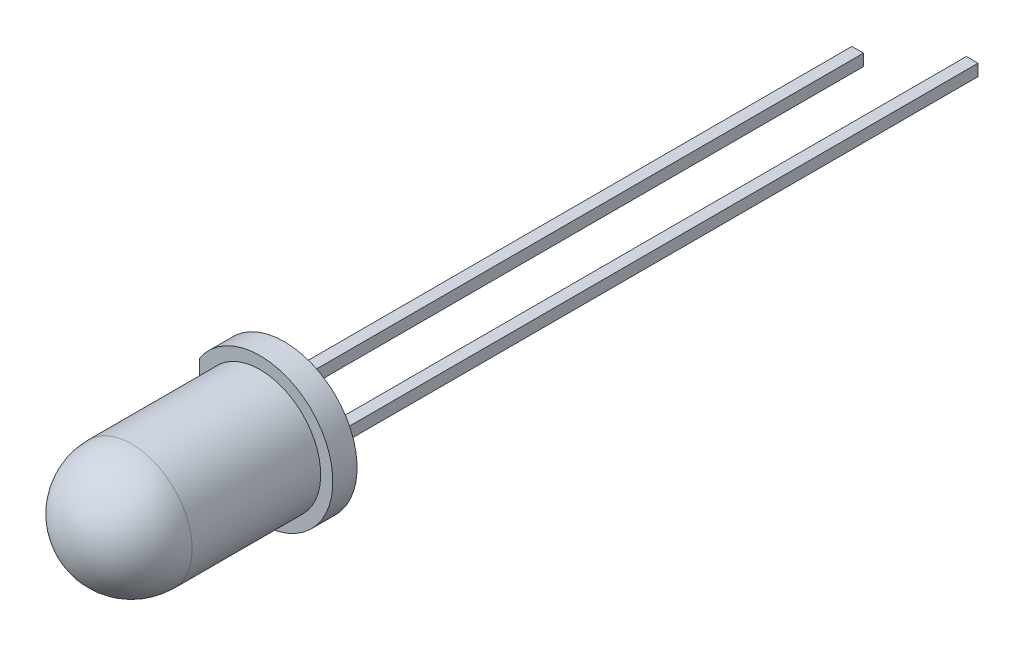
ISO-10303-21;
HEADER;
FILE_DESCRIPTION(('STEP AP214'),'2;1');
FILE_NAME('part.step','',(''),(''),'','','');
FILE_SCHEMA(('AUTOMOTIVE_DESIGN { 1 0 10303 214 1 1 1 1 }'));
ENDSEC;
DATA;
#1=APPLICATION_CONTEXT('core data for automotive mechanical design processes');
#2=APPLICATION_PROTOCOL_DEFINITION('international standard','automotive_design',2000,#1);
#3=PRODUCT_CONTEXT('',#1,'mechanical');
#4=PRODUCT('Part','Part','',(#3));
#5=PRODUCT_RELATED_PRODUCT_CATEGORY('part','',(#4));
#6=PRODUCT_DEFINITION_FORMATION('','',#4);
#7=PRODUCT_DEFINITION_CONTEXT('part definition',#1,'design');
#8=PRODUCT_DEFINITION('design','',#6,#7);
#9=PRODUCT_DEFINITION_SHAPE('','',#8);
#10=(LENGTH_UNIT() NAMED_UNIT(*) SI_UNIT(.MILLI.,.METRE.));
#11=(NAMED_UNIT(*) PLANE_ANGLE_UNIT() SI_UNIT($,.RADIAN.));
#12=(NAMED_UNIT(*) SI_UNIT($,.STERADIAN.) SOLID_ANGLE_UNIT());
#13=UNCERTAINTY_MEASURE_WITH_UNIT(LENGTH_MEASURE(1.E-05),#10,'distance_accuracy_value','');
#14=(GEOMETRIC_REPRESENTATION_CONTEXT(3) GLOBAL_UNCERTAINTY_ASSIGNED_CONTEXT((#13)) GLOBAL_UNIT_ASSIGNED_CONTEXT((#10,
#11,#12)) REPRESENTATION_CONTEXT('',''));
#15=CARTESIAN_POINT('',(0.,0.,0.));
#16=DIRECTION('',(0.,0.,1.));
#17=DIRECTION('',(1.,0.,0.));
#18=AXIS2_PLACEMENT_3D('',#15,#16,#17);
#19=CARTESIAN_POINT('',(-0.0499999999999997,0.,4.26666666666667));
#20=DIRECTION('',(0.,0.,1.));
#21=DIRECTION('',(-1.,0.,0.));
#22=AXIS2_PLACEMENT_3D('',#19,#20,#21);
#23=SPHERICAL_SURFACE('',#22,0.566666666666667);
#24=CARTESIAN_POINT('',(-0.0499999999999997,-0.24,4.26666666666667));
#25=DIRECTION('',(0.,1.,0.));
#26=DIRECTION('',(0.,0.,1.));
#27=AXIS2_PLACEMENT_3D('',#24,#25,#26);
#28=CIRCLE('',#27,0.513333333333333);
#29=CARTESIAN_POINT('',(-0.488634243989226,-0.24,4.));
#30=VERTEX_POINT('',#29);
#31=CARTESIAN_POINT('',(0.388634243989226,-0.24,4.));
#32=VERTEX_POINT('',#31);
#33=EDGE_CURVE('E204',#30,#32,#28,.F.);
#34=ORIENTED_EDGE('',*,*,#33,.T.);
#35=CARTESIAN_POINT('',(-0.0499999999999997,0.,4.));
#36=DIRECTION('',(0.,0.,1.));
#37=DIRECTION('',(1.,0.,0.));
#38=AXIS2_PLACEMENT_3D('',#35,#36,#37);
#39=CIRCLE('',#38,0.5);
#40=EDGE_CURVE('E71',#30,#32,#39,.T.);
#41=ORIENTED_EDGE('',*,*,#40,.F.);
#42=EDGE_LOOP('',(#34,#41));
#43=FACE_BOUND('',#42,.T.);
#44=ADVANCED_FACE('F62',(#43),#23,.T.);
#45=CARTESIAN_POINT('',(0.388634243989226,0.24,4.));
#46=VERTEX_POINT('',#45);
#47=CARTESIAN_POINT('',(-0.488634243989226,0.24,4.));
#48=VERTEX_POINT('',#47);
#49=EDGE_CURVE('E12',#46,#48,#39,.T.);
#50=ORIENTED_EDGE('',*,*,#49,.F.);
#51=CARTESIAN_POINT('',(-0.0499999999999997,0.24,4.26666666666667));
#52=DIRECTION('',(0.,1.,0.));
#53=DIRECTION('',(0.,0.,1.));
#54=AXIS2_PLACEMENT_3D('',#51,#52,#53);
#55=CIRCLE('',#54,0.513333333333333);
#56=EDGE_CURVE('E232',#48,#46,#55,.F.);
#57=ORIENTED_EDGE('',*,*,#56,.F.);
#58=EDGE_LOOP('',(#50,#57));
#59=FACE_BOUND('',#58,.T.);
#60=ADVANCED_FACE('F64',(#59),#23,.T.);
#61=CARTESIAN_POINT('',(-0.55,0.,4.));
#62=DIRECTION('',(0.,0.,-1.));
#63=DIRECTION('',(-1.,0.,0.));
#64=AXIS2_PLACEMENT_3D('',#61,#62,#63);
#65=PLANE('',#64);
#66=CARTESIAN_POINT('',(-0.0499999999999997,0.,4.));
#67=DIRECTION('',(0.,0.,1.));
#68=DIRECTION('',(1.,0.,0.));
#69=AXIS2_PLACEMENT_3D('',#66,#67,#68);
#70=CIRCLE('',#69,0.2);
#71=CARTESIAN_POINT('',(0.15,0.,4.));
#72=VERTEX_POINT('',#71);
#73=EDGE_CURVE('E317',#72,#72,#70,.T.);
#74=ORIENTED_EDGE('',*,*,#73,.F.);
#75=EDGE_LOOP('',(#74));
#76=FACE_BOUND('',#75,.T.);
#77=ORIENTED_EDGE('',*,*,#49,.T.);
#78=DIRECTION('',(1.,0.,0.));
#79=VECTOR('',#78,1.);
#80=CARTESIAN_POINT('',(-1.3,0.24,4.));
#81=LINE('',#80,#79);
#82=CARTESIAN_POINT('',(-1.3,0.24,4.));
#83=VERTEX_POINT('',#82);
#84=EDGE_CURVE('E128',#83,#48,#81,.T.);
#85=ORIENTED_EDGE('',*,*,#84,.F.);
#86=DIRECTION('',(0.,-1.,0.));
#87=VECTOR('',#86,1.);
#88=CARTESIAN_POINT('',(-1.3,0.24,4.));
#89=LINE('',#88,#87);
#90=CARTESIAN_POINT('',(-1.3,-0.24,4.));
#91=VERTEX_POINT('',#90);
#92=EDGE_CURVE('E202',#83,#91,#89,.T.);
#93=ORIENTED_EDGE('',*,*,#92,.T.);
#94=DIRECTION('',(1.,0.,0.));
#95=VECTOR('',#94,1.);
#96=CARTESIAN_POINT('',(-1.3,-0.24,4.));
#97=LINE('',#96,#95);
#98=EDGE_CURVE('E81',#91,#30,#97,.T.);
#99=ORIENTED_EDGE('',*,*,#98,.T.);
#100=ORIENTED_EDGE('',*,*,#40,.T.);
#101=CARTESIAN_POINT('',(1.2,-0.24,4.));
#102=VERTEX_POINT('',#101);
#103=EDGE_CURVE('E180',#32,#102,#97,.T.);
#104=ORIENTED_EDGE('',*,*,#103,.T.);
#105=DIRECTION('',(0.,-1.,0.));
#106=VECTOR('',#105,1.);
#107=CARTESIAN_POINT('',(1.2,0.24,4.));
#108=LINE('',#107,#106);
#109=CARTESIAN_POINT('',(1.2,0.24,4.));
#110=VERTEX_POINT('',#109);
#111=EDGE_CURVE('E160',#110,#102,#108,.T.);
#112=ORIENTED_EDGE('',*,*,#111,.F.);
#113=EDGE_CURVE('E146',#46,#110,#81,.T.);
#114=ORIENTED_EDGE('',*,*,#113,.F.);
#115=EDGE_LOOP('',(#77,#85,#93,#99,#100,#104,#112,#114));
#116=FACE_BOUND('',#115,.T.);
#117=ADVANCED_FACE('F214',(#76,#116),#65,.F.);
#118=CARTESIAN_POINT('',(0.,0.24,0.));
#119=DIRECTION('',(0.,1.,0.));
#120=DIRECTION('',(0.,0.,1.));
#121=AXIS2_PLACEMENT_3D('',#118,#119,#120);
#122=PLANE('',#121);
#123=ORIENTED_EDGE('',*,*,#84,.T.);
#124=ORIENTED_EDGE('',*,*,#56,.T.);
#125=ORIENTED_EDGE('',*,*,#113,.T.);
#126=DIRECTION('',(-0.508148861978286,0.,-0.861269257590315));
#127=VECTOR('',#126,1.);
#128=CARTESIAN_POINT('',(1.2,0.24,4.));
#129=LINE('',#128,#127);
#130=CARTESIAN_POINT('',(0.0199999999999998,0.24,2.));
#131=VERTEX_POINT('',#130);
#132=EDGE_CURVE('E137',#110,#131,#129,.T.);
#133=ORIENTED_EDGE('',*,*,#132,.T.);
#134=DIRECTION('',(-1.,0.,0.));
#135=VECTOR('',#134,1.);
#136=CARTESIAN_POINT('',(0.0199999999999998,0.24,2.));
#137=LINE('',#136,#135);
#138=CARTESIAN_POINT('',(-1.12,0.24,2.));
#139=VERTEX_POINT('',#138);
#140=EDGE_CURVE('E142',#131,#139,#137,.T.);
#141=ORIENTED_EDGE('',*,*,#140,.T.);
#142=DIRECTION('',(0.,0.,-1.));
#143=VECTOR('',#142,1.);
#144=CARTESIAN_POINT('',(-1.12,0.24,2.));
#145=LINE('',#144,#143);
#146=CARTESIAN_POINT('',(-1.12,0.24,-25.));
#147=VERTEX_POINT('',#146);
#148=EDGE_CURVE('E167',#139,#147,#145,.T.);
#149=ORIENTED_EDGE('',*,*,#148,.T.);
#150=DIRECTION('',(1.,0.,0.));
#151=VECTOR('',#150,1.);
#152=CARTESIAN_POINT('',(-1.12,0.24,-25.));
#153=LINE('',#152,#151);
#154=CARTESIAN_POINT('',(-1.6,0.24,-25.));
#155=VERTEX_POINT('',#154);
#156=EDGE_CURVE('E181',#155,#147,#153,.T.);
#157=ORIENTED_EDGE('',*,*,#156,.F.);
#158=DIRECTION('',(0.,0.,1.));
#159=VECTOR('',#158,1.);
#160=CARTESIAN_POINT('',(-1.6,0.24,0.));
#161=LINE('',#160,#159);
#162=CARTESIAN_POINT('',(-1.6,0.24,3.5));
#163=VERTEX_POINT('',#162);
#164=EDGE_CURVE('E93',#155,#163,#161,.T.);
#165=ORIENTED_EDGE('',*,*,#164,.T.);
#166=DIRECTION('',(0.514495755427526,0.,0.857492925712544));
#167=VECTOR('',#166,1.);
#168=CARTESIAN_POINT('',(-1.6,0.24,3.5));
#169=LINE('',#168,#167);
#170=EDGE_CURVE('E195',#163,#83,#169,.T.);
#171=ORIENTED_EDGE('',*,*,#170,.T.);
#172=EDGE_LOOP('',(#123,#124,#125,#133,#141,#149,#157,#165,#171));
#173=FACE_BOUND('',#172,.T.);
#174=ADVANCED_FACE('F139',(#173),#122,.T.);
#175=CARTESIAN_POINT('',(0.,-0.24,0.));
#176=DIRECTION('',(0.,1.,0.));
#177=DIRECTION('',(0.,0.,1.));
#178=AXIS2_PLACEMENT_3D('',#175,#176,#177);
#179=PLANE('',#178);
#180=ORIENTED_EDGE('',*,*,#33,.F.);
#181=ORIENTED_EDGE('',*,*,#98,.F.);
#182=DIRECTION('',(0.514495755427526,0.,0.857492925712544));
#183=VECTOR('',#182,1.);
#184=CARTESIAN_POINT('',(-1.6,-0.24,3.5));
#185=LINE('',#184,#183);
#186=CARTESIAN_POINT('',(-1.6,-0.24,3.5));
#187=VERTEX_POINT('',#186);
#188=EDGE_CURVE('E176',#187,#91,#185,.T.);
#189=ORIENTED_EDGE('',*,*,#188,.F.);
#190=DIRECTION('',(0.,0.,1.));
#191=VECTOR('',#190,1.);
#192=CARTESIAN_POINT('',(-1.6,-0.24,0.));
#193=LINE('',#192,#191);
#194=CARTESIAN_POINT('',(-1.6,-0.24,-25.));
#195=VERTEX_POINT('',#194);
#196=EDGE_CURVE('E122',#195,#187,#193,.T.);
#197=ORIENTED_EDGE('',*,*,#196,.F.);
#198=DIRECTION('',(-1.,0.,0.));
#199=VECTOR('',#198,1.);
#200=CARTESIAN_POINT('',(-1.12,-0.24,-25.));
#201=LINE('',#200,#199);
#202=CARTESIAN_POINT('',(-1.12,-0.24,-25.));
#203=VERTEX_POINT('',#202);
#204=EDGE_CURVE('E259',#203,#195,#201,.T.);
#205=ORIENTED_EDGE('',*,*,#204,.F.);
#206=DIRECTION('',(0.,0.,-1.));
#207=VECTOR('',#206,1.);
#208=CARTESIAN_POINT('',(-1.12,-0.24,2.));
#209=LINE('',#208,#207);
#210=CARTESIAN_POINT('',(-1.12,-0.24,2.));
#211=VERTEX_POINT('',#210);
#212=EDGE_CURVE('E189',#211,#203,#209,.T.);
#213=ORIENTED_EDGE('',*,*,#212,.F.);
#214=DIRECTION('',(-1.,0.,0.));
#215=VECTOR('',#214,1.);
#216=CARTESIAN_POINT('',(0.0199999999999998,-0.24,2.));
#217=LINE('',#216,#215);
#218=CARTESIAN_POINT('',(0.0199999999999998,-0.24,2.));
#219=VERTEX_POINT('',#218);
#220=EDGE_CURVE('E186',#219,#211,#217,.T.);
#221=ORIENTED_EDGE('',*,*,#220,.F.);
#222=DIRECTION('',(-0.508148861978286,0.,-0.861269257590315));
#223=VECTOR('',#222,1.);
#224=CARTESIAN_POINT('',(1.2,-0.24,4.));
#225=LINE('',#224,#223);
#226=EDGE_CURVE('E156',#102,#219,#225,.T.);
#227=ORIENTED_EDGE('',*,*,#226,.F.);
#228=ORIENTED_EDGE('',*,*,#103,.F.);
#229=EDGE_LOOP('',(#180,#181,#189,#197,#205,#213,#221,#227,#228));
#230=FACE_BOUND('',#229,.T.);
#231=ADVANCED_FACE('F278',(#230),#179,.F.);
#232=CARTESIAN_POINT('',(-1.6,0.24,3.5));
#233=DIRECTION('',(0.857492925712544,0.,-0.514495755427526));
#234=DIRECTION('',(-0.514495755427526,0.,-0.857492925712544));
#235=AXIS2_PLACEMENT_3D('',#232,#233,#234);
#236=PLANE('',#235);
#237=ORIENTED_EDGE('',*,*,#188,.T.);
#238=ORIENTED_EDGE('',*,*,#92,.F.);
#239=ORIENTED_EDGE('',*,*,#170,.F.);
#240=DIRECTION('',(0.,-1.,0.));
#241=VECTOR('',#240,1.);
#242=CARTESIAN_POINT('',(-1.6,0.24,3.5));
#243=LINE('',#242,#241);
#244=EDGE_CURVE('E175',#163,#187,#243,.T.);
#245=ORIENTED_EDGE('',*,*,#244,.T.);
#246=EDGE_LOOP('',(#237,#238,#239,#245));
#247=FACE_BOUND('',#246,.T.);
#248=ADVANCED_FACE('F275',(#247),#236,.F.);
#249=CARTESIAN_POINT('',(1.2,0.24,4.));
#250=DIRECTION('',(-0.861269257590315,0.,0.508148861978286));
#251=DIRECTION('',(0.508148861978286,0.,0.861269257590315));
#252=AXIS2_PLACEMENT_3D('',#249,#250,#251);
#253=PLANE('',#252);
#254=ORIENTED_EDGE('',*,*,#226,.T.);
#255=DIRECTION('',(0.,-1.,0.));
#256=VECTOR('',#255,1.);
#257=CARTESIAN_POINT('',(0.0199999999999998,0.24,2.));
#258=LINE('',#257,#256);
#259=EDGE_CURVE('E153',#131,#219,#258,.T.);
#260=ORIENTED_EDGE('',*,*,#259,.F.);
#261=ORIENTED_EDGE('',*,*,#132,.F.);
#262=ORIENTED_EDGE('',*,*,#111,.T.);
#263=EDGE_LOOP('',(#254,#260,#261,#262));
#264=FACE_BOUND('',#263,.T.);
#265=ADVANCED_FACE('F154',(#264),#253,.F.);
#266=CARTESIAN_POINT('',(0.0199999999999998,0.24,2.));
#267=DIRECTION('',(0.,0.,1.));
#268=DIRECTION('',(1.,0.,0.));
#269=AXIS2_PLACEMENT_3D('',#266,#267,#268);
#270=PLANE('',#269);
#271=ORIENTED_EDGE('',*,*,#220,.T.);
#272=DIRECTION('',(0.,-1.,0.));
#273=VECTOR('',#272,1.);
#274=CARTESIAN_POINT('',(-1.12,0.24,2.));
#275=LINE('',#274,#273);
#276=EDGE_CURVE('E161',#139,#211,#275,.T.);
#277=ORIENTED_EDGE('',*,*,#276,.F.);
#278=ORIENTED_EDGE('',*,*,#140,.F.);
#279=ORIENTED_EDGE('',*,*,#259,.T.);
#280=EDGE_LOOP('',(#271,#277,#278,#279));
#281=FACE_BOUND('',#280,.T.);
#282=ADVANCED_FACE('F163',(#281),#270,.F.);
#283=CARTESIAN_POINT('',(-1.12,0.24,2.));
#284=DIRECTION('',(-1.,0.,0.));
#285=DIRECTION('',(0.,0.,1.));
#286=AXIS2_PLACEMENT_3D('',#283,#284,#285);
#287=PLANE('',#286);
#288=ORIENTED_EDGE('',*,*,#212,.T.);
#289=DIRECTION('',(0.,-1.,0.));
#290=VECTOR('',#289,1.);
#291=CARTESIAN_POINT('',(-1.12,-0.24,-25.));
#292=LINE('',#291,#290);
#293=EDGE_CURVE('E251',#147,#203,#292,.T.);
#294=ORIENTED_EDGE('',*,*,#293,.F.);
#295=ORIENTED_EDGE('',*,*,#148,.F.);
#296=ORIENTED_EDGE('',*,*,#276,.T.);
#297=EDGE_LOOP('',(#288,#294,#295,#296));
#298=FACE_BOUND('',#297,.T.);
#299=ADVANCED_FACE('F255',(#298),#287,.F.);
#300=CARTESIAN_POINT('',(-1.6,0.24,0.));
#301=DIRECTION('',(1.,0.,0.));
#302=DIRECTION('',(0.,0.,-1.));
#303=AXIS2_PLACEMENT_3D('',#300,#301,#302);
#304=PLANE('',#303);
#305=ORIENTED_EDGE('',*,*,#196,.T.);
#306=ORIENTED_EDGE('',*,*,#244,.F.);
#307=ORIENTED_EDGE('',*,*,#164,.F.);
#308=DIRECTION('',(0.,1.,0.));
#309=VECTOR('',#308,1.);
#310=CARTESIAN_POINT('',(-1.6,-0.24,-25.));
#311=LINE('',#310,#309);
#312=EDGE_CURVE('E252',#195,#155,#311,.T.);
#313=ORIENTED_EDGE('',*,*,#312,.F.);
#314=EDGE_LOOP('',(#305,#306,#307,#313));
#315=FACE_BOUND('',#314,.T.);
#316=ADVANCED_FACE('F279',(#315),#304,.F.);
#317=CARTESIAN_POINT('',(0.,0.,-25.));
#318=DIRECTION('',(0.,0.,1.));
#319=DIRECTION('',(1.,0.,0.));
#320=AXIS2_PLACEMENT_3D('',#317,#318,#319);
#321=PLANE('',#320);
#322=ORIENTED_EDGE('',*,*,#293,.T.);
#323=ORIENTED_EDGE('',*,*,#204,.T.);
#324=ORIENTED_EDGE('',*,*,#312,.T.);
#325=ORIENTED_EDGE('',*,*,#156,.T.);
#326=EDGE_LOOP('',(#322,#323,#324,#325));
#327=FACE_BOUND('',#326,.T.);
#328=ADVANCED_FACE('F249',(#327),#321,.F.);
#329=CARTESIAN_POINT('',(-0.0499999999999997,0.,3.9));
#330=DIRECTION('',(0.,0.,1.));
#331=DIRECTION('',(1.,0.,0.));
#332=AXIS2_PLACEMENT_3D('',#329,#330,#331);
#333=CYLINDRICAL_SURFACE('',#332,0.2);
#334=CARTESIAN_POINT('',(-0.0499999999999997,0.,3.9));
#335=DIRECTION('',(0.,0.,1.));
#336=DIRECTION('',(1.,0.,0.));
#337=AXIS2_PLACEMENT_3D('',#334,#335,#336);
#338=CIRCLE('',#337,0.2);
#339=CARTESIAN_POINT('',(0.15,0.,3.9));
#340=VERTEX_POINT('',#339);
#341=EDGE_CURVE('E264',#340,#340,#338,.T.);
#342=ORIENTED_EDGE('',*,*,#341,.F.);
#343=EDGE_LOOP('',(#342));
#344=FACE_BOUND('',#343,.T.);
#345=ORIENTED_EDGE('',*,*,#73,.T.);
#346=EDGE_LOOP('',(#345));
#347=FACE_BOUND('',#346,.T.);
#348=ADVANCED_FACE('F286',(#344,#347),#333,.F.);
#349=CARTESIAN_POINT('',(-0.0499999999999997,0.,3.9));
#350=DIRECTION('',(0.,0.,1.));
#351=DIRECTION('',(1.,0.,0.));
#352=AXIS2_PLACEMENT_3D('',#349,#350,#351);
#353=PLANE('',#352);
#354=ORIENTED_EDGE('',*,*,#341,.T.);
#355=EDGE_LOOP('',(#354));
#356=FACE_BOUND('',#355,.T.);
#357=ADVANCED_FACE('F308',(#356),#353,.T.);
#358=CLOSED_SHELL('',(#44,#60,#117,#174,#231,#248,#265,#282,#299,#316,#328,#348,#357));
#359=MANIFOLD_SOLID_BREP('B2',#358);
#360=CARTESIAN_POINT('',(1.12,0.24,2.));
#361=DIRECTION('',(0.,0.,1.));
#362=DIRECTION('',(1.,0.,0.));
#363=AXIS2_PLACEMENT_3D('',#360,#361,#362);
#364=PLANE('',#363);
#365=DIRECTION('',(-1.,0.,0.));
#366=VECTOR('',#365,1.);
#367=CARTESIAN_POINT('',(1.12,-0.24,2.));
#368=LINE('',#367,#366);
#369=CARTESIAN_POINT('',(1.12,-0.24,2.));
#370=VERTEX_POINT('',#369);
#371=CARTESIAN_POINT('',(0.22,-0.24,2.));
#372=VERTEX_POINT('',#371);
#373=EDGE_CURVE('E539',#370,#372,#368,.T.);
#374=ORIENTED_EDGE('',*,*,#373,.T.);
#375=DIRECTION('',(0.,-1.,0.));
#376=VECTOR('',#375,1.);
#377=CARTESIAN_POINT('',(0.22,0.24,2.));
#378=LINE('',#377,#376);
#379=CARTESIAN_POINT('',(0.22,0.24,2.));
#380=VERTEX_POINT('',#379);
#381=EDGE_CURVE('E60',#380,#372,#378,.T.);
#382=ORIENTED_EDGE('',*,*,#381,.F.);
#383=DIRECTION('',(-1.,0.,0.));
#384=VECTOR('',#383,1.);
#385=CARTESIAN_POINT('',(1.12,0.24,2.));
#386=LINE('',#385,#384);
#387=CARTESIAN_POINT('',(1.12,0.24,2.));
#388=VERTEX_POINT('',#387);
#389=EDGE_CURVE('E540',#388,#380,#386,.T.);
#390=ORIENTED_EDGE('',*,*,#389,.F.);
#391=DIRECTION('',(0.,-1.,0.));
#392=VECTOR('',#391,1.);
#393=CARTESIAN_POINT('',(1.12,0.24,2.));
#394=LINE('',#393,#392);
#395=EDGE_CURVE('E549',#388,#370,#394,.T.);
#396=ORIENTED_EDGE('',*,*,#395,.T.);
#397=EDGE_LOOP('',(#374,#382,#390,#396));
#398=FACE_BOUND('',#397,.T.);
#399=ADVANCED_FACE('F434',(#398),#364,.F.);
#400=CARTESIAN_POINT('',(0.22,0.24,2.));
#401=DIRECTION('',(0.861269257590315,0.,-0.508148861978286));
#402=DIRECTION('',(-0.508148861978286,0.,-0.861269257590315));
#403=AXIS2_PLACEMENT_3D('',#400,#401,#402);
#404=PLANE('',#403);
#405=DIRECTION('',(0.508148861978286,0.,0.861269257590315));
#406=VECTOR('',#405,1.);
#407=CARTESIAN_POINT('',(0.22,-0.24,2.));
#408=LINE('',#407,#406);
#409=CARTESIAN_POINT('',(1.4,-0.24,4.));
#410=VERTEX_POINT('',#409);
#411=EDGE_CURVE('E553',#372,#410,#408,.T.);
#412=ORIENTED_EDGE('',*,*,#411,.T.);
#413=DIRECTION('',(0.,-1.,0.));
#414=VECTOR('',#413,1.);
#415=CARTESIAN_POINT('',(1.4,0.24,4.));
#416=LINE('',#415,#414);
#417=CARTESIAN_POINT('',(1.4,0.24,4.));
#418=VERTEX_POINT('',#417);
#419=EDGE_CURVE('E443',#418,#410,#416,.T.);
#420=ORIENTED_EDGE('',*,*,#419,.F.);
#421=DIRECTION('',(0.508148861978286,0.,0.861269257590315));
#422=VECTOR('',#421,1.);
#423=CARTESIAN_POINT('',(0.22,0.24,2.));
#424=LINE('',#423,#422);
#425=EDGE_CURVE('E492',#380,#418,#424,.T.);
#426=ORIENTED_EDGE('',*,*,#425,.F.);
#427=ORIENTED_EDGE('',*,*,#381,.T.);
#428=EDGE_LOOP('',(#412,#420,#426,#427));
#429=FACE_BOUND('',#428,.T.);
#430=ADVANCED_FACE('F574',(#429),#404,.F.);
#431=CARTESIAN_POINT('',(1.4,0.24,4.));
#432=DIRECTION('',(0.,0.,-1.));
#433=DIRECTION('',(-1.,0.,0.));
#434=AXIS2_PLACEMENT_3D('',#431,#432,#433);
#435=PLANE('',#434);
#436=DIRECTION('',(1.,0.,0.));
#437=VECTOR('',#436,1.);
#438=CARTESIAN_POINT('',(1.4,-0.24,4.));
#439=LINE('',#438,#437);
#440=CARTESIAN_POINT('',(1.6,-0.24,4.));
#441=VERTEX_POINT('',#440);
#442=EDGE_CURVE('E477',#410,#441,#439,.T.);
#443=ORIENTED_EDGE('',*,*,#442,.T.);
#444=DIRECTION('',(0.,-1.,0.));
#445=VECTOR('',#444,1.);
#446=CARTESIAN_POINT('',(1.6,0.24,4.));
#447=LINE('',#446,#445);
#448=CARTESIAN_POINT('',(1.6,0.24,4.));
#449=VERTEX_POINT('',#448);
#450=EDGE_CURVE('E564',#449,#441,#447,.T.);
#451=ORIENTED_EDGE('',*,*,#450,.F.);
#452=DIRECTION('',(1.,0.,0.));
#453=VECTOR('',#452,1.);
#454=CARTESIAN_POINT('',(1.4,0.24,4.));
#455=LINE('',#454,#453);
#456=EDGE_CURVE('E513',#418,#449,#455,.T.);
#457=ORIENTED_EDGE('',*,*,#456,.F.);
#458=ORIENTED_EDGE('',*,*,#419,.T.);
#459=EDGE_LOOP('',(#443,#451,#457,#458));
#460=FACE_BOUND('',#459,.T.);
#461=ADVANCED_FACE('F566',(#460),#435,.F.);
#462=CARTESIAN_POINT('',(1.6,0.24,4.));
#463=DIRECTION('',(-1.,0.,0.));
#464=DIRECTION('',(0.,0.,1.));
#465=AXIS2_PLACEMENT_3D('',#462,#463,#464);
#466=PLANE('',#465);
#467=DIRECTION('',(0.,0.,-1.));
#468=VECTOR('',#467,1.);
#469=CARTESIAN_POINT('',(1.6,-0.24,4.));
#470=LINE('',#469,#468);
#471=CARTESIAN_POINT('',(1.6,-0.24,-27.));
#472=VERTEX_POINT('',#471);
#473=EDGE_CURVE('E521',#441,#472,#470,.T.);
#474=ORIENTED_EDGE('',*,*,#473,.T.);
#475=DIRECTION('',(0.,-1.,0.));
#476=VECTOR('',#475,1.);
#477=CARTESIAN_POINT('',(1.6,0.24,-27.));
#478=LINE('',#477,#476);
#479=CARTESIAN_POINT('',(1.6,0.24,-27.));
#480=VERTEX_POINT('',#479);
#481=EDGE_CURVE('E518',#480,#472,#478,.T.);
#482=ORIENTED_EDGE('',*,*,#481,.F.);
#483=DIRECTION('',(0.,0.,-1.));
#484=VECTOR('',#483,1.);
#485=CARTESIAN_POINT('',(1.6,0.24,4.));
#486=LINE('',#485,#484);
#487=EDGE_CURVE('E507',#449,#480,#486,.T.);
#488=ORIENTED_EDGE('',*,*,#487,.F.);
#489=ORIENTED_EDGE('',*,*,#450,.T.);
#490=EDGE_LOOP('',(#474,#482,#488,#489));
#491=FACE_BOUND('',#490,.T.);
#492=ADVANCED_FACE('F519',(#491),#466,.F.);
#493=CARTESIAN_POINT('',(1.12,0.24,0.));
#494=DIRECTION('',(1.,0.,0.));
#495=DIRECTION('',(0.,0.,-1.));
#496=AXIS2_PLACEMENT_3D('',#493,#494,#495);
#497=PLANE('',#496);
#498=DIRECTION('',(0.,0.,1.));
#499=VECTOR('',#498,1.);
#500=CARTESIAN_POINT('',(1.12,-0.24,0.));
#501=LINE('',#500,#499);
#502=CARTESIAN_POINT('',(1.12,-0.24,-27.));
#503=VERTEX_POINT('',#502);
#504=EDGE_CURVE('E485',#503,#370,#501,.T.);
#505=ORIENTED_EDGE('',*,*,#504,.T.);
#506=ORIENTED_EDGE('',*,*,#395,.F.);
#507=DIRECTION('',(0.,0.,1.));
#508=VECTOR('',#507,1.);
#509=CARTESIAN_POINT('',(1.12,0.24,0.));
#510=LINE('',#509,#508);
#511=CARTESIAN_POINT('',(1.12,0.24,-27.));
#512=VERTEX_POINT('',#511);
#513=EDGE_CURVE('E453',#512,#388,#510,.T.);
#514=ORIENTED_EDGE('',*,*,#513,.F.);
#515=DIRECTION('',(0.,1.,0.));
#516=VECTOR('',#515,1.);
#517=CARTESIAN_POINT('',(1.12,-0.24,-27.));
#518=LINE('',#517,#516);
#519=EDGE_CURVE('E530',#503,#512,#518,.T.);
#520=ORIENTED_EDGE('',*,*,#519,.F.);
#521=EDGE_LOOP('',(#505,#506,#514,#520));
#522=FACE_BOUND('',#521,.T.);
#523=ADVANCED_FACE('F570',(#522),#497,.F.);
#524=CARTESIAN_POINT('',(0.,0.24,0.));
#525=DIRECTION('',(0.,-1.,0.));
#526=DIRECTION('',(0.,0.,-1.));
#527=AXIS2_PLACEMENT_3D('',#524,#525,#526);
#528=PLANE('',#527);
#529=ORIENTED_EDGE('',*,*,#389,.T.);
#530=ORIENTED_EDGE('',*,*,#425,.T.);
#531=ORIENTED_EDGE('',*,*,#456,.T.);
#532=ORIENTED_EDGE('',*,*,#487,.T.);
#533=DIRECTION('',(1.,0.,0.));
#534=VECTOR('',#533,1.);
#535=CARTESIAN_POINT('',(1.12,0.24,-27.));
#536=LINE('',#535,#534);
#537=EDGE_CURVE('E511',#512,#480,#536,.T.);
#538=ORIENTED_EDGE('',*,*,#537,.F.);
#539=ORIENTED_EDGE('',*,*,#513,.T.);
#540=EDGE_LOOP('',(#529,#530,#531,#532,#538,#539));
#541=FACE_BOUND('',#540,.T.);
#542=ADVANCED_FACE('F509',(#541),#528,.F.);
#543=CARTESIAN_POINT('',(0.,-0.24,0.));
#544=DIRECTION('',(0.,-1.,0.));
#545=DIRECTION('',(0.,0.,-1.));
#546=AXIS2_PLACEMENT_3D('',#543,#544,#545);
#547=PLANE('',#546);
#548=ORIENTED_EDGE('',*,*,#373,.F.);
#549=ORIENTED_EDGE('',*,*,#504,.F.);
#550=DIRECTION('',(-1.,0.,0.));
#551=VECTOR('',#550,1.);
#552=CARTESIAN_POINT('',(1.6,-0.24,-27.));
#553=LINE('',#552,#551);
#554=EDGE_CURVE('E526',#472,#503,#553,.T.);
#555=ORIENTED_EDGE('',*,*,#554,.F.);
#556=ORIENTED_EDGE('',*,*,#473,.F.);
#557=ORIENTED_EDGE('',*,*,#442,.F.);
#558=ORIENTED_EDGE('',*,*,#411,.F.);
#559=EDGE_LOOP('',(#548,#549,#555,#556,#557,#558));
#560=FACE_BOUND('',#559,.T.);
#561=ADVANCED_FACE('F569',(#560),#547,.T.);
#562=CARTESIAN_POINT('',(0.,0.,-27.));
#563=DIRECTION('',(0.,0.,-1.));
#564=DIRECTION('',(-1.,0.,0.));
#565=AXIS2_PLACEMENT_3D('',#562,#563,#564);
#566=PLANE('',#565);
#567=ORIENTED_EDGE('',*,*,#537,.T.);
#568=ORIENTED_EDGE('',*,*,#481,.T.);
#569=ORIENTED_EDGE('',*,*,#554,.T.);
#570=ORIENTED_EDGE('',*,*,#519,.T.);
#571=EDGE_LOOP('',(#567,#568,#569,#570));
#572=FACE_BOUND('',#571,.T.);
#573=ADVANCED_FACE('F529',(#572),#566,.T.);
#574=CLOSED_SHELL('',(#399,#430,#461,#492,#523,#542,#561,#573));
#575=MANIFOLD_SOLID_BREP('B6',#574);
#576=CARTESIAN_POINT('',(0.,0.,1.));
#577=DIRECTION('',(0.,0.,-1.));
#578=DIRECTION('',(-1.,0.,0.));
#579=AXIS2_PLACEMENT_3D('',#576,#577,#578);
#580=CYLINDRICAL_SURFACE('',#579,3.);
#581=CARTESIAN_POINT('',(0.,0.,1.));
#582=DIRECTION('',(0.,0.,1.));
#583=DIRECTION('',(1.,0.,0.));
#584=AXIS2_PLACEMENT_3D('',#581,#582,#583);
#585=CIRCLE('',#584,3.);
#586=CARTESIAN_POINT('',(-2.5,-1.6583123951777,1.));
#587=VERTEX_POINT('',#586);
#588=CARTESIAN_POINT('',(-2.5,1.6583123951777,1.));
#589=VERTEX_POINT('',#588);
#590=EDGE_CURVE('E683',#587,#589,#585,.T.);
#591=ORIENTED_EDGE('',*,*,#590,.F.);
#592=DIRECTION('',(0.,0.,-1.));
#593=VECTOR('',#592,1.);
#594=CARTESIAN_POINT('',(-2.5,-1.6583123951777,4.35410196624969));
#595=LINE('',#594,#593);
#596=CARTESIAN_POINT('',(-2.5,-1.6583123951777,0.));
#597=VERTEX_POINT('',#596);
#598=EDGE_CURVE('E931',#587,#597,#595,.T.);
#599=ORIENTED_EDGE('',*,*,#598,.T.);
#600=CARTESIAN_POINT('',(0.,0.,0.));
#601=DIRECTION('',(0.,0.,1.));
#602=DIRECTION('',(1.,0.,0.));
#603=AXIS2_PLACEMENT_3D('',#600,#601,#602);
#604=CIRCLE('',#603,3.);
#605=CARTESIAN_POINT('',(-2.5,1.6583123951777,0.));
#606=VERTEX_POINT('',#605);
#607=EDGE_CURVE('E942',#597,#606,#604,.T.);
#608=ORIENTED_EDGE('',*,*,#607,.T.);
#609=DIRECTION('',(0.,0.,-1.));
#610=VECTOR('',#609,1.);
#611=CARTESIAN_POINT('',(-2.5,1.6583123951777,4.35410196624969));
#612=LINE('',#611,#610);
#613=EDGE_CURVE('E935',#589,#606,#612,.T.);
#614=ORIENTED_EDGE('',*,*,#613,.F.);
#615=EDGE_LOOP('',(#591,#599,#608,#614));
#616=FACE_BOUND('',#615,.T.);
#617=ADVANCED_FACE('F675',(#616),#580,.T.);
#618=CARTESIAN_POINT('',(0.,0.,1.));
#619=DIRECTION('',(0.,0.,1.));
#620=DIRECTION('',(1.,0.,0.));
#621=AXIS2_PLACEMENT_3D('',#618,#619,#620);
#622=PLANE('',#621);
#623=DIRECTION('',(0.,-1.,0.));
#624=VECTOR('',#623,1.);
#625=CARTESIAN_POINT('',(-2.5,1.6583123951777,1.));
#626=LINE('',#625,#624);
#627=CARTESIAN_POINT('',(-2.5,0.,1.));
#628=VERTEX_POINT('',#627);
#629=EDGE_CURVE('E925',#628,#587,#626,.T.);
#630=ORIENTED_EDGE('',*,*,#629,.T.);
#631=ORIENTED_EDGE('',*,*,#590,.T.);
#632=EDGE_CURVE('E927',#589,#628,#626,.T.);
#633=ORIENTED_EDGE('',*,*,#632,.T.);
#634=CARTESIAN_POINT('',(0.,0.,1.));
#635=DIRECTION('',(0.,0.,1.));
#636=DIRECTION('',(1.,0.,0.));
#637=AXIS2_PLACEMENT_3D('',#634,#635,#636);
#638=CIRCLE('',#637,2.5);
#639=EDGE_CURVE('E432',#628,#628,#638,.T.);
#640=ORIENTED_EDGE('',*,*,#639,.F.);
#641=EDGE_LOOP('',(#630,#631,#633,#640));
#642=FACE_BOUND('',#641,.T.);
#643=ADVANCED_FACE('F957',(#642),#622,.T.);
#644=CARTESIAN_POINT('',(0.,0.,0.));
#645=DIRECTION('',(0.,0.,1.));
#646=DIRECTION('',(1.,0.,0.));
#647=AXIS2_PLACEMENT_3D('',#644,#645,#646);
#648=PLANE('',#647);
#649=DIRECTION('',(0.,1.,0.));
#650=VECTOR('',#649,1.);
#651=CARTESIAN_POINT('',(-1.6,-0.24,0.));
#652=LINE('',#651,#650);
#653=CARTESIAN_POINT('',(-1.6,-0.24,0.));
#654=VERTEX_POINT('',#653);
#655=CARTESIAN_POINT('',(-1.6,0.24,0.));
#656=VERTEX_POINT('',#655);
#657=EDGE_CURVE('E821',#654,#656,#652,.T.);
#658=ORIENTED_EDGE('',*,*,#657,.F.);
#659=DIRECTION('',(-1.,0.,0.));
#660=VECTOR('',#659,1.);
#661=CARTESIAN_POINT('',(-1.6,-0.24,0.));
#662=LINE('',#661,#660);
#663=CARTESIAN_POINT('',(-1.12,-0.24,0.));
#664=VERTEX_POINT('',#663);
#665=EDGE_CURVE('E829',#664,#654,#662,.T.);
#666=ORIENTED_EDGE('',*,*,#665,.F.);
#667=DIRECTION('',(0.,1.,0.));
#668=VECTOR('',#667,1.);
#669=CARTESIAN_POINT('',(-1.12,-0.24,0.));
#670=LINE('',#669,#668);
#671=CARTESIAN_POINT('',(-1.12,0.24,0.));
#672=VERTEX_POINT('',#671);
#673=EDGE_CURVE('E926',#664,#672,#670,.T.);
#674=ORIENTED_EDGE('',*,*,#673,.T.);
#675=DIRECTION('',(-1.,0.,0.));
#676=VECTOR('',#675,1.);
#677=CARTESIAN_POINT('',(-1.6,0.24,0.));
#678=LINE('',#677,#676);
#679=EDGE_CURVE('E844',#672,#656,#678,.T.);
#680=ORIENTED_EDGE('',*,*,#679,.T.);
#681=EDGE_LOOP('',(#658,#666,#674,#680));
#682=FACE_BOUND('',#681,.T.);
#683=DIRECTION('',(0.,1.,0.));
#684=VECTOR('',#683,1.);
#685=CARTESIAN_POINT('',(1.12,-0.24,0.));
#686=LINE('',#685,#684);
#687=CARTESIAN_POINT('',(1.12,-0.24,0.));
#688=VERTEX_POINT('',#687);
#689=CARTESIAN_POINT('',(1.12,0.24,0.));
#690=VERTEX_POINT('',#689);
#691=EDGE_CURVE('E882',#688,#690,#686,.T.);
#692=ORIENTED_EDGE('',*,*,#691,.F.);
#693=DIRECTION('',(-1.,0.,0.));
#694=VECTOR('',#693,1.);
#695=CARTESIAN_POINT('',(1.12,-0.24,0.));
#696=LINE('',#695,#694);
#697=CARTESIAN_POINT('',(1.6,-0.24,0.));
#698=VERTEX_POINT('',#697);
#699=EDGE_CURVE('E857',#698,#688,#696,.T.);
#700=ORIENTED_EDGE('',*,*,#699,.F.);
#701=DIRECTION('',(0.,1.,0.));
#702=VECTOR('',#701,1.);
#703=CARTESIAN_POINT('',(1.6,-0.24,0.));
#704=LINE('',#703,#702);
#705=CARTESIAN_POINT('',(1.6,0.24,0.));
#706=VERTEX_POINT('',#705);
#707=EDGE_CURVE('E904',#698,#706,#704,.T.);
#708=ORIENTED_EDGE('',*,*,#707,.T.);
#709=DIRECTION('',(-1.,0.,0.));
#710=VECTOR('',#709,1.);
#711=CARTESIAN_POINT('',(1.12,0.24,0.));
#712=LINE('',#711,#710);
#713=EDGE_CURVE('E883',#706,#690,#712,.T.);
#714=ORIENTED_EDGE('',*,*,#713,.T.);
#715=EDGE_LOOP('',(#692,#700,#708,#714));
#716=FACE_BOUND('',#715,.T.);
#717=ORIENTED_EDGE('',*,*,#607,.F.);
#718=DIRECTION('',(0.,-1.,0.));
#719=VECTOR('',#718,1.);
#720=CARTESIAN_POINT('',(-2.5,1.6583123951777,0.));
#721=LINE('',#720,#719);
#722=EDGE_CURVE('E922',#606,#597,#721,.T.);
#723=ORIENTED_EDGE('',*,*,#722,.F.);
#724=EDGE_LOOP('',(#717,#723));
#725=FACE_BOUND('',#724,.T.);
#726=ADVANCED_FACE('F842',(#682,#716,#725),#648,.F.);
#727=CARTESIAN_POINT('',(0.,0.,6.3));
#728=DIRECTION('',(0.,0.,-1.));
#729=DIRECTION('',(0.,1.,0.));
#730=AXIS2_PLACEMENT_3D('',#727,#728,#729);
#731=SPHERICAL_SURFACE('',#730,2.5);
#732=CARTESIAN_POINT('',(0.,0.,6.3));
#733=DIRECTION('',(0.,0.,-1.));
#734=DIRECTION('',(0.,1.,0.));
#735=AXIS2_PLACEMENT_3D('',#732,#733,#734);
#736=CIRCLE('',#735,2.5);
#737=CARTESIAN_POINT('',(0.,2.5,6.3));
#738=VERTEX_POINT('',#737);
#739=EDGE_CURVE('E938',#738,#738,#736,.T.);
#740=ORIENTED_EDGE('',*,*,#739,.F.);
#741=EDGE_LOOP('',(#740));
#742=FACE_BOUND('',#741,.T.);
#743=ADVANCED_FACE('F961',(#742),#731,.T.);
#744=CARTESIAN_POINT('',(0.,0.,1.));
#745=DIRECTION('',(0.,0.,-1.));
#746=DIRECTION('',(0.,1.,0.));
#747=AXIS2_PLACEMENT_3D('',#744,#745,#746);
#748=CYLINDRICAL_SURFACE('',#747,2.5);
#749=ORIENTED_EDGE('',*,*,#739,.T.);
#750=EDGE_LOOP('',(#749));
#751=FACE_BOUND('',#750,.T.);
#752=ORIENTED_EDGE('',*,*,#639,.T.);
#753=EDGE_LOOP('',(#752));
#754=FACE_BOUND('',#753,.T.);
#755=ADVANCED_FACE('F959',(#751,#754),#748,.T.);
#756=CARTESIAN_POINT('',(-2.5,1.6583123951777,4.35410196624969));
#757=DIRECTION('',(1.,0.,0.));
#758=DIRECTION('',(0.,0.,-1.));
#759=AXIS2_PLACEMENT_3D('',#756,#757,#758);
#760=PLANE('',#759);
#761=ORIENTED_EDGE('',*,*,#613,.T.);
#762=ORIENTED_EDGE('',*,*,#722,.T.);
#763=ORIENTED_EDGE('',*,*,#598,.F.);
#764=ORIENTED_EDGE('',*,*,#629,.F.);
#765=ORIENTED_EDGE('',*,*,#632,.F.);
#766=EDGE_LOOP('',(#761,#762,#763,#764,#765));
#767=FACE_BOUND('',#766,.T.);
#768=ADVANCED_FACE('F953',(#767),#760,.F.);
#769=CARTESIAN_POINT('',(1.6,-0.24,0.));
#770=DIRECTION('',(1.,0.,0.));
#771=DIRECTION('',(0.,0.,-1.));
#772=AXIS2_PLACEMENT_3D('',#769,#770,#771);
#773=PLANE('',#772);
#774=DIRECTION('',(0.,0.,-1.));
#775=VECTOR('',#774,1.);
#776=CARTESIAN_POINT('',(1.6,0.24,0.));
#777=LINE('',#776,#775);
#778=CARTESIAN_POINT('',(1.6,0.24,4.));
#779=VERTEX_POINT('',#778);
#780=EDGE_CURVE('E862',#779,#706,#777,.T.);
#781=ORIENTED_EDGE('',*,*,#780,.T.);
#782=ORIENTED_EDGE('',*,*,#707,.F.);
#783=DIRECTION('',(0.,0.,-1.));
#784=VECTOR('',#783,1.);
#785=CARTESIAN_POINT('',(1.6,-0.24,0.));
#786=LINE('',#785,#784);
#787=CARTESIAN_POINT('',(1.6,-0.24,4.));
#788=VERTEX_POINT('',#787);
#789=EDGE_CURVE('E878',#788,#698,#786,.T.);
#790=ORIENTED_EDGE('',*,*,#789,.F.);
#791=DIRECTION('',(0.,1.,0.));
#792=VECTOR('',#791,1.);
#793=CARTESIAN_POINT('',(1.6,-0.24,4.));
#794=LINE('',#793,#792);
#795=EDGE_CURVE('E908',#788,#779,#794,.T.);
#796=ORIENTED_EDGE('',*,*,#795,.T.);
#797=EDGE_LOOP('',(#781,#782,#790,#796));
#798=FACE_BOUND('',#797,.T.);
#799=ADVANCED_FACE('F968',(#798),#773,.F.);
#800=CARTESIAN_POINT('',(1.6,-0.24,4.));
#801=DIRECTION('',(0.,0.,1.));
#802=DIRECTION('',(1.,0.,0.));
#803=AXIS2_PLACEMENT_3D('',#800,#801,#802);
#804=PLANE('',#803);
#805=DIRECTION('',(1.,0.,0.));
#806=VECTOR('',#805,1.);
#807=CARTESIAN_POINT('',(1.6,0.24,4.));
#808=LINE('',#807,#806);
#809=CARTESIAN_POINT('',(1.4,0.24,4.));
#810=VERTEX_POINT('',#809);
#811=EDGE_CURVE('E897',#810,#779,#808,.T.);
#812=ORIENTED_EDGE('',*,*,#811,.T.);
#813=ORIENTED_EDGE('',*,*,#795,.F.);
#814=DIRECTION('',(1.,0.,0.));
#815=VECTOR('',#814,1.);
#816=CARTESIAN_POINT('',(1.6,-0.24,4.));
#817=LINE('',#816,#815);
#818=CARTESIAN_POINT('',(1.4,-0.24,4.));
#819=VERTEX_POINT('',#818);
#820=EDGE_CURVE('E874',#819,#788,#817,.T.);
#821=ORIENTED_EDGE('',*,*,#820,.F.);
#822=DIRECTION('',(0.,1.,0.));
#823=VECTOR('',#822,1.);
#824=CARTESIAN_POINT('',(1.4,-0.24,4.));
#825=LINE('',#824,#823);
#826=EDGE_CURVE('E911',#819,#810,#825,.T.);
#827=ORIENTED_EDGE('',*,*,#826,.T.);
#828=EDGE_LOOP('',(#812,#813,#821,#827));
#829=FACE_BOUND('',#828,.T.);
#830=ADVANCED_FACE('F1108',(#829),#804,.F.);
#831=CARTESIAN_POINT('',(1.4,-0.24,4.));
#832=DIRECTION('',(-0.861269257590315,0.,0.508148861978286));
#833=DIRECTION('',(0.508148861978286,0.,0.861269257590315));
#834=AXIS2_PLACEMENT_3D('',#831,#832,#833);
#835=PLANE('',#834);
#836=DIRECTION('',(0.508148861978286,0.,0.861269257590315));
#837=VECTOR('',#836,1.);
#838=CARTESIAN_POINT('',(1.4,0.24,4.));
#839=LINE('',#838,#837);
#840=CARTESIAN_POINT('',(0.22,0.24,2.));
#841=VERTEX_POINT('',#840);
#842=EDGE_CURVE('E893',#841,#810,#839,.T.);
#843=ORIENTED_EDGE('',*,*,#842,.T.);
#844=ORIENTED_EDGE('',*,*,#826,.F.);
#845=DIRECTION('',(0.508148861978286,0.,0.861269257590315));
#846=VECTOR('',#845,1.);
#847=CARTESIAN_POINT('',(1.4,-0.24,4.));
#848=LINE('',#847,#846);
#849=CARTESIAN_POINT('',(0.22,-0.24,2.));
#850=VERTEX_POINT('',#849);
#851=EDGE_CURVE('E870',#850,#819,#848,.T.);
#852=ORIENTED_EDGE('',*,*,#851,.F.);
#853=DIRECTION('',(0.,1.,0.));
#854=VECTOR('',#853,1.);
#855=CARTESIAN_POINT('',(0.22,-0.24,2.));
#856=LINE('',#855,#854);
#857=EDGE_CURVE('E914',#850,#841,#856,.T.);
#858=ORIENTED_EDGE('',*,*,#857,.T.);
#859=EDGE_LOOP('',(#843,#844,#852,#858));
#860=FACE_BOUND('',#859,.T.);
#861=ADVANCED_FACE('F1099',(#860),#835,.F.);
#862=CARTESIAN_POINT('',(0.22,-0.24,2.));
#863=DIRECTION('',(0.,0.,-1.));
#864=DIRECTION('',(-1.,0.,0.));
#865=AXIS2_PLACEMENT_3D('',#862,#863,#864);
#866=PLANE('',#865);
#867=DIRECTION('',(-1.,0.,0.));
#868=VECTOR('',#867,1.);
#869=CARTESIAN_POINT('',(0.22,0.24,2.));
#870=LINE('',#869,#868);
#871=CARTESIAN_POINT('',(1.12,0.24,2.));
#872=VERTEX_POINT('',#871);
#873=EDGE_CURVE('E889',#872,#841,#870,.T.);
#874=ORIENTED_EDGE('',*,*,#873,.T.);
#875=ORIENTED_EDGE('',*,*,#857,.F.);
#876=DIRECTION('',(-1.,0.,0.));
#877=VECTOR('',#876,1.);
#878=CARTESIAN_POINT('',(0.22,-0.24,2.));
#879=LINE('',#878,#877);
#880=CARTESIAN_POINT('',(1.12,-0.24,2.));
#881=VERTEX_POINT('',#880);
#882=EDGE_CURVE('E866',#881,#850,#879,.T.);
#883=ORIENTED_EDGE('',*,*,#882,.F.);
#884=DIRECTION('',(0.,1.,0.));
#885=VECTOR('',#884,1.);
#886=CARTESIAN_POINT('',(1.12,-0.24,2.));
#887=LINE('',#886,#885);
#888=EDGE_CURVE('E917',#881,#872,#887,.T.);
#889=ORIENTED_EDGE('',*,*,#888,.T.);
#890=EDGE_LOOP('',(#874,#875,#883,#889));
#891=FACE_BOUND('',#890,.T.);
#892=ADVANCED_FACE('F1090',(#891),#866,.F.);
#893=CARTESIAN_POINT('',(1.12,-0.24,2.));
#894=DIRECTION('',(-1.,0.,0.));
#895=DIRECTION('',(0.,0.,1.));
#896=AXIS2_PLACEMENT_3D('',#893,#894,#895);
#897=PLANE('',#896);
#898=DIRECTION('',(0.,0.,1.));
#899=VECTOR('',#898,1.);
#900=CARTESIAN_POINT('',(1.12,0.24,2.));
#901=LINE('',#900,#899);
#902=EDGE_CURVE('E703',#690,#872,#901,.T.);
#903=ORIENTED_EDGE('',*,*,#902,.T.);
#904=ORIENTED_EDGE('',*,*,#888,.F.);
#905=DIRECTION('',(0.,0.,1.));
#906=VECTOR('',#905,1.);
#907=CARTESIAN_POINT('',(1.12,-0.24,2.));
#908=LINE('',#907,#906);
#909=EDGE_CURVE('E861',#688,#881,#908,.T.);
#910=ORIENTED_EDGE('',*,*,#909,.F.);
#911=ORIENTED_EDGE('',*,*,#691,.T.);
#912=EDGE_LOOP('',(#903,#904,#910,#911));
#913=FACE_BOUND('',#912,.T.);
#914=ADVANCED_FACE('F1081',(#913),#897,.F.);
#915=CARTESIAN_POINT('',(0.,-0.24,0.));
#916=DIRECTION('',(0.,-1.,0.));
#917=DIRECTION('',(0.,0.,-1.));
#918=AXIS2_PLACEMENT_3D('',#915,#916,#917);
#919=PLANE('',#918);
#920=ORIENTED_EDGE('',*,*,#699,.T.);
#921=ORIENTED_EDGE('',*,*,#909,.T.);
#922=ORIENTED_EDGE('',*,*,#882,.T.);
#923=ORIENTED_EDGE('',*,*,#851,.T.);
#924=ORIENTED_EDGE('',*,*,#820,.T.);
#925=ORIENTED_EDGE('',*,*,#789,.T.);
#926=EDGE_LOOP('',(#920,#921,#922,#923,#924,#925));
#927=FACE_BOUND('',#926,.T.);
#928=ADVANCED_FACE('F1073',(#927),#919,.F.);
#929=CARTESIAN_POINT('',(0.,0.24,0.));
#930=DIRECTION('',(0.,-1.,0.));
#931=DIRECTION('',(0.,0.,-1.));
#932=AXIS2_PLACEMENT_3D('',#929,#930,#931);
#933=PLANE('',#932);
#934=ORIENTED_EDGE('',*,*,#713,.F.);
#935=ORIENTED_EDGE('',*,*,#780,.F.);
#936=ORIENTED_EDGE('',*,*,#811,.F.);
#937=ORIENTED_EDGE('',*,*,#842,.F.);
#938=ORIENTED_EDGE('',*,*,#873,.F.);
#939=ORIENTED_EDGE('',*,*,#902,.F.);
#940=EDGE_LOOP('',(#934,#935,#936,#937,#938,#939));
#941=FACE_BOUND('',#940,.T.);
#942=ADVANCED_FACE('F1017',(#941),#933,.T.);
#943=CARTESIAN_POINT('',(-1.12,-0.24,0.));
#944=DIRECTION('',(1.,0.,0.));
#945=DIRECTION('',(0.,0.,-1.));
#946=AXIS2_PLACEMENT_3D('',#943,#944,#945);
#947=PLANE('',#946);
#948=DIRECTION('',(0.,0.,-1.));
#949=VECTOR('',#948,1.);
#950=CARTESIAN_POINT('',(-1.12,0.24,0.));
#951=LINE('',#950,#949);
#952=CARTESIAN_POINT('',(-1.12,0.24,2.));
#953=VERTEX_POINT('',#952);
#954=EDGE_CURVE('E840',#953,#672,#951,.T.);
#955=ORIENTED_EDGE('',*,*,#954,.T.);
#956=ORIENTED_EDGE('',*,*,#673,.F.);
#957=DIRECTION('',(0.,0.,-1.));
#958=VECTOR('',#957,1.);
#959=CARTESIAN_POINT('',(-1.12,-0.24,0.));
#960=LINE('',#959,#958);
#961=CARTESIAN_POINT('',(-1.12,-0.24,2.));
#962=VERTEX_POINT('',#961);
#963=EDGE_CURVE('E836',#962,#664,#960,.T.);
#964=ORIENTED_EDGE('',*,*,#963,.F.);
#965=DIRECTION('',(0.,1.,0.));
#966=VECTOR('',#965,1.);
#967=CARTESIAN_POINT('',(-1.12,-0.24,2.));
#968=LINE('',#967,#966);
#969=EDGE_CURVE('E1177',#962,#953,#968,.T.);
#970=ORIENTED_EDGE('',*,*,#969,.T.);
#971=EDGE_LOOP('',(#955,#956,#964,#970));
#972=FACE_BOUND('',#971,.T.);
#973=ADVANCED_FACE('F1012',(#972),#947,.F.);
#974=CARTESIAN_POINT('',(-1.12,-0.24,2.));
#975=DIRECTION('',(0.,0.,-1.));
#976=DIRECTION('',(-1.,0.,0.));
#977=AXIS2_PLACEMENT_3D('',#974,#975,#976);
#978=PLANE('',#977);
#979=DIRECTION('',(-1.,0.,0.));
#980=VECTOR('',#979,1.);
#981=CARTESIAN_POINT('',(-1.12,0.24,2.));
#982=LINE('',#981,#980);
#983=CARTESIAN_POINT('',(0.0199999999999998,0.24,2.));
#984=VERTEX_POINT('',#983);
#985=EDGE_CURVE('E1174',#984,#953,#982,.T.);
#986=ORIENTED_EDGE('',*,*,#985,.T.);
#987=ORIENTED_EDGE('',*,*,#969,.F.);
#988=DIRECTION('',(-1.,0.,0.));
#989=VECTOR('',#988,1.);
#990=CARTESIAN_POINT('',(-1.12,-0.24,2.));
#991=LINE('',#990,#989);
#992=CARTESIAN_POINT('',(0.0199999999999998,-0.24,2.));
#993=VERTEX_POINT('',#992);
#994=EDGE_CURVE('E853',#993,#962,#991,.T.);
#995=ORIENTED_EDGE('',*,*,#994,.F.);
#996=DIRECTION('',(0.,1.,0.));
#997=VECTOR('',#996,1.);
#998=CARTESIAN_POINT('',(0.0199999999999998,-0.24,2.));
#999=LINE('',#998,#997);
#1000=EDGE_CURVE('E1178',#993,#984,#999,.T.);
#1001=ORIENTED_EDGE('',*,*,#1000,.T.);
#1002=EDGE_LOOP('',(#986,#987,#995,#1001));
#1003=FACE_BOUND('',#1002,.T.);
#1004=ADVANCED_FACE('F1016',(#1003),#978,.F.);
#1005=CARTESIAN_POINT('',(0.0199999999999998,-0.24,2.));
#1006=DIRECTION('',(0.861269257590315,0.,-0.508148861978286));
#1007=DIRECTION('',(-0.508148861978286,0.,-0.861269257590315));
#1008=AXIS2_PLACEMENT_3D('',#1005,#1006,#1007);
#1009=PLANE('',#1008);
#1010=DIRECTION('',(-0.508148861978286,0.,-0.861269257590315));
#1011=VECTOR('',#1010,1.);
#1012=CARTESIAN_POINT('',(0.0199999999999998,0.24,2.));
#1013=LINE('',#1012,#1011);
#1014=CARTESIAN_POINT('',(1.2,0.24,4.));
#1015=VERTEX_POINT('',#1014);
#1016=EDGE_CURVE('E1182',#1015,#984,#1013,.T.);
#1017=ORIENTED_EDGE('',*,*,#1016,.T.);
#1018=ORIENTED_EDGE('',*,*,#1000,.F.);
#1019=DIRECTION('',(-0.508148861978286,0.,-0.861269257590315));
#1020=VECTOR('',#1019,1.);
#1021=CARTESIAN_POINT('',(0.0199999999999998,-0.24,2.));
#1022=LINE('',#1021,#1020);
#1023=CARTESIAN_POINT('',(1.2,-0.24,4.));
#1024=VERTEX_POINT('',#1023);
#1025=EDGE_CURVE('E1218',#1024,#993,#1022,.T.);
#1026=ORIENTED_EDGE('',*,*,#1025,.F.);
#1027=DIRECTION('',(0.,1.,0.));
#1028=VECTOR('',#1027,1.);
#1029=CARTESIAN_POINT('',(1.2,-0.24,4.));
#1030=LINE('',#1029,#1028);
#1031=EDGE_CURVE('E1195',#1024,#1015,#1030,.T.);
#1032=ORIENTED_EDGE('',*,*,#1031,.T.);
#1033=EDGE_LOOP('',(#1017,#1018,#1026,#1032));
#1034=FACE_BOUND('',#1033,.T.);
#1035=ADVANCED_FACE('F1050',(#1034),#1009,.F.);
#1036=CARTESIAN_POINT('',(1.2,-0.24,4.));
#1037=DIRECTION('',(0.,0.,1.));
#1038=DIRECTION('',(1.,0.,0.));
#1039=AXIS2_PLACEMENT_3D('',#1036,#1037,#1038);
#1040=PLANE('',#1039);
#1041=DIRECTION('',(1.,0.,0.));
#1042=VECTOR('',#1041,1.);
#1043=CARTESIAN_POINT('',(1.2,0.24,4.));
#1044=LINE('',#1043,#1042);
#1045=CARTESIAN_POINT('',(-1.3,0.24,4.));
#1046=VERTEX_POINT('',#1045);
#1047=EDGE_CURVE('E1203',#1046,#1015,#1044,.T.);
#1048=ORIENTED_EDGE('',*,*,#1047,.T.);
#1049=ORIENTED_EDGE('',*,*,#1031,.F.);
#1050=DIRECTION('',(1.,0.,0.));
#1051=VECTOR('',#1050,1.);
#1052=CARTESIAN_POINT('',(1.2,-0.24,4.));
#1053=LINE('',#1052,#1051);
#1054=CARTESIAN_POINT('',(-1.3,-0.24,4.));
#1055=VERTEX_POINT('',#1054);
#1056=EDGE_CURVE('E1205',#1055,#1024,#1053,.T.);
#1057=ORIENTED_EDGE('',*,*,#1056,.F.);
#1058=DIRECTION('',(0.,1.,0.));
#1059=VECTOR('',#1058,1.);
#1060=CARTESIAN_POINT('',(-1.3,-0.24,4.));
#1061=LINE('',#1060,#1059);
#1062=EDGE_CURVE('E850',#1055,#1046,#1061,.T.);
#1063=ORIENTED_EDGE('',*,*,#1062,.T.);
#1064=EDGE_LOOP('',(#1048,#1049,#1057,#1063));
#1065=FACE_BOUND('',#1064,.T.);
#1066=ADVANCED_FACE('F1041',(#1065),#1040,.F.);
#1067=CARTESIAN_POINT('',(-1.3,-0.24,4.));
#1068=DIRECTION('',(-0.857492925712544,0.,0.514495755427526));
#1069=DIRECTION('',(0.514495755427526,0.,0.857492925712544));
#1070=AXIS2_PLACEMENT_3D('',#1067,#1068,#1069);
#1071=PLANE('',#1070);
#1072=DIRECTION('',(0.514495755427526,0.,0.857492925712544));
#1073=VECTOR('',#1072,1.);
#1074=CARTESIAN_POINT('',(-1.3,0.24,4.));
#1075=LINE('',#1074,#1073);
#1076=CARTESIAN_POINT('',(-1.6,0.24,3.5));
#1077=VERTEX_POINT('',#1076);
#1078=EDGE_CURVE('E1207',#1077,#1046,#1075,.T.);
#1079=ORIENTED_EDGE('',*,*,#1078,.T.);
#1080=ORIENTED_EDGE('',*,*,#1062,.F.);
#1081=DIRECTION('',(0.514495755427526,0.,0.857492925712544));
#1082=VECTOR('',#1081,1.);
#1083=CARTESIAN_POINT('',(-1.3,-0.24,4.));
#1084=LINE('',#1083,#1082);
#1085=CARTESIAN_POINT('',(-1.6,-0.24,3.5));
#1086=VERTEX_POINT('',#1085);
#1087=EDGE_CURVE('E828',#1086,#1055,#1084,.T.);
#1088=ORIENTED_EDGE('',*,*,#1087,.F.);
#1089=DIRECTION('',(0.,1.,0.));
#1090=VECTOR('',#1089,1.);
#1091=CARTESIAN_POINT('',(-1.6,-0.24,3.5));
#1092=LINE('',#1091,#1090);
#1093=EDGE_CURVE('E823',#1086,#1077,#1092,.T.);
#1094=ORIENTED_EDGE('',*,*,#1093,.T.);
#1095=EDGE_LOOP('',(#1079,#1080,#1088,#1094));
#1096=FACE_BOUND('',#1095,.T.);
#1097=ADVANCED_FACE('F1005',(#1096),#1071,.F.);
#1098=CARTESIAN_POINT('',(-1.6,-0.24,0.));
#1099=DIRECTION('',(-1.,0.,0.));
#1100=DIRECTION('',(0.,0.,1.));
#1101=AXIS2_PLACEMENT_3D('',#1098,#1099,#1100);
#1102=PLANE('',#1101);
#1103=DIRECTION('',(0.,0.,1.));
#1104=VECTOR('',#1103,1.);
#1105=CARTESIAN_POINT('',(-1.6,0.24,0.));
#1106=LINE('',#1105,#1104);
#1107=EDGE_CURVE('E692',#656,#1077,#1106,.T.);
#1108=ORIENTED_EDGE('',*,*,#1107,.T.);
#1109=ORIENTED_EDGE('',*,*,#1093,.F.);
#1110=DIRECTION('',(0.,0.,1.));
#1111=VECTOR('',#1110,1.);
#1112=CARTESIAN_POINT('',(-1.6,-0.24,0.));
#1113=LINE('',#1112,#1111);
#1114=EDGE_CURVE('E817',#654,#1086,#1113,.T.);
#1115=ORIENTED_EDGE('',*,*,#1114,.F.);
#1116=ORIENTED_EDGE('',*,*,#657,.T.);
#1117=EDGE_LOOP('',(#1108,#1109,#1115,#1116));
#1118=FACE_BOUND('',#1117,.T.);
#1119=ADVANCED_FACE('F819',(#1118),#1102,.F.);
#1120=CARTESIAN_POINT('',(0.,-0.24,0.));
#1121=DIRECTION('',(0.,-1.,0.));
#1122=DIRECTION('',(0.,0.,-1.));
#1123=AXIS2_PLACEMENT_3D('',#1120,#1121,#1122);
#1124=PLANE('',#1123);
#1125=ORIENTED_EDGE('',*,*,#665,.T.);
#1126=ORIENTED_EDGE('',*,*,#1114,.T.);
#1127=ORIENTED_EDGE('',*,*,#1087,.T.);
#1128=ORIENTED_EDGE('',*,*,#1056,.T.);
#1129=ORIENTED_EDGE('',*,*,#1025,.T.);
#1130=ORIENTED_EDGE('',*,*,#994,.T.);
#1131=ORIENTED_EDGE('',*,*,#963,.T.);
#1132=EDGE_LOOP('',(#1125,#1126,#1127,#1128,#1129,#1130,#1131));
#1133=FACE_BOUND('',#1132,.T.);
#1134=ADVANCED_FACE('F833',(#1133),#1124,.F.);
#1135=CARTESIAN_POINT('',(0.,0.24,0.));
#1136=DIRECTION('',(0.,-1.,0.));
#1137=DIRECTION('',(0.,0.,-1.));
#1138=AXIS2_PLACEMENT_3D('',#1135,#1136,#1137);
#1139=PLANE('',#1138);
#1140=ORIENTED_EDGE('',*,*,#679,.F.);
#1141=ORIENTED_EDGE('',*,*,#954,.F.);
#1142=ORIENTED_EDGE('',*,*,#985,.F.);
#1143=ORIENTED_EDGE('',*,*,#1016,.F.);
#1144=ORIENTED_EDGE('',*,*,#1047,.F.);
#1145=ORIENTED_EDGE('',*,*,#1078,.F.);
#1146=ORIENTED_EDGE('',*,*,#1107,.F.);
#1147=EDGE_LOOP('',(#1140,#1141,#1142,#1143,#1144,#1145,#1146));
#1148=FACE_BOUND('',#1147,.T.);
#1149=ADVANCED_FACE('F995',(#1148),#1139,.T.);
#1150=CLOSED_SHELL('',(#617,#643,#726,#743,#755,#768,#799,#830,#861,#892,#914,#928,#942,#973,
#1004,#1035,#1066,#1097,#1119,#1134,#1149));
#1151=MANIFOLD_SOLID_BREP('B54',#1150);
#1152=ADVANCED_BREP_SHAPE_REPRESENTATION('',(#18,#359,#575,#1151),#14);
#1153=SHAPE_DEFINITION_REPRESENTATION(#9,#1152);
ENDSEC;
END-ISO-10303-21;
